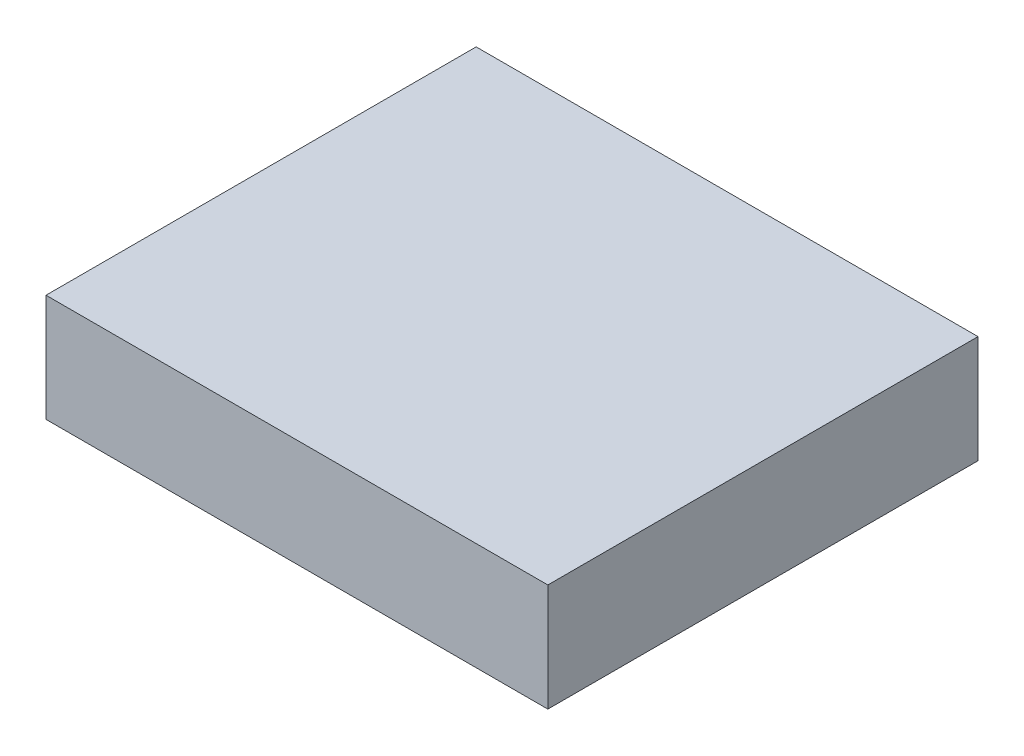
ISO-10303-21;
HEADER;
FILE_DESCRIPTION(('STEP AP214'),'2;1');
FILE_NAME('part.step','',(''),(''),'','','');
FILE_SCHEMA(('AUTOMOTIVE_DESIGN { 1 0 10303 214 1 1 1 1 }'));
ENDSEC;
DATA;
#1=APPLICATION_CONTEXT('core data for automotive mechanical design processes');
#2=APPLICATION_PROTOCOL_DEFINITION('international standard','automotive_design',2000,#1);
#3=PRODUCT_CONTEXT('',#1,'mechanical');
#4=PRODUCT('Part','Part','',(#3));
#5=PRODUCT_RELATED_PRODUCT_CATEGORY('part','',(#4));
#6=PRODUCT_DEFINITION_FORMATION('','',#4);
#7=PRODUCT_DEFINITION_CONTEXT('part definition',#1,'design');
#8=PRODUCT_DEFINITION('design','',#6,#7);
#9=PRODUCT_DEFINITION_SHAPE('','',#8);
#10=(LENGTH_UNIT() NAMED_UNIT(*) SI_UNIT(.MILLI.,.METRE.));
#11=(NAMED_UNIT(*) PLANE_ANGLE_UNIT() SI_UNIT($,.RADIAN.));
#12=(NAMED_UNIT(*) SI_UNIT($,.STERADIAN.) SOLID_ANGLE_UNIT());
#13=UNCERTAINTY_MEASURE_WITH_UNIT(LENGTH_MEASURE(1.E-05),#10,'distance_accuracy_value','');
#14=(GEOMETRIC_REPRESENTATION_CONTEXT(3) GLOBAL_UNCERTAINTY_ASSIGNED_CONTEXT((#13)) GLOBAL_UNIT_ASSIGNED_CONTEXT((#10,
#11,#12)) REPRESENTATION_CONTEXT('',''));
#15=CARTESIAN_POINT('',(0.,0.,0.));
#16=DIRECTION('',(0.,0.,1.));
#17=DIRECTION('',(1.,0.,0.));
#18=AXIS2_PLACEMENT_3D('',#15,#16,#17);
#19=CARTESIAN_POINT('',(-1.84150326797386,0.75,-0.869281045751634));
#20=DIRECTION('',(1.,0.,0.));
#21=DIRECTION('',(0.,0.,-1.));
#22=AXIS2_PLACEMENT_3D('',#19,#20,#21);
#23=PLANE('',#22);
#24=DIRECTION('',(0.,0.,1.));
#25=VECTOR('',#24,1.);
#26=CARTESIAN_POINT('',(-1.84150326797386,0.,-0.869281045751634));
#27=LINE('',#26,#25);
#28=CARTESIAN_POINT('',(-1.84150326797386,0.,-0.869281045751634));
#29=VERTEX_POINT('',#28);
#30=CARTESIAN_POINT('',(-1.84150326797386,0.,2.13071895424837));
#31=VERTEX_POINT('',#30);
#32=EDGE_CURVE('E109',#29,#31,#27,.T.);
#33=ORIENTED_EDGE('',*,*,#32,.T.);
#34=DIRECTION('',(0.,-1.,0.));
#35=VECTOR('',#34,1.);
#36=CARTESIAN_POINT('',(-1.84150326797386,0.75,2.13071895424837));
#37=LINE('',#36,#35);
#38=CARTESIAN_POINT('',(-1.84150326797386,0.75,2.13071895424837));
#39=VERTEX_POINT('',#38);
#40=EDGE_CURVE('E11',#39,#31,#37,.T.);
#41=ORIENTED_EDGE('',*,*,#40,.F.);
#42=DIRECTION('',(0.,0.,1.));
#43=VECTOR('',#42,1.);
#44=CARTESIAN_POINT('',(-1.84150326797386,0.75,-0.869281045751634));
#45=LINE('',#44,#43);
#46=CARTESIAN_POINT('',(-1.84150326797386,0.75,-0.869281045751634));
#47=VERTEX_POINT('',#46);
#48=EDGE_CURVE('E93',#47,#39,#45,.T.);
#49=ORIENTED_EDGE('',*,*,#48,.F.);
#50=DIRECTION('',(0.,-1.,0.));
#51=VECTOR('',#50,1.);
#52=CARTESIAN_POINT('',(-1.84150326797386,0.75,-0.869281045751634));
#53=LINE('',#52,#51);
#54=EDGE_CURVE('E105',#47,#29,#53,.T.);
#55=ORIENTED_EDGE('',*,*,#54,.T.);
#56=EDGE_LOOP('',(#33,#41,#49,#55));
#57=FACE_BOUND('',#56,.T.);
#58=ADVANCED_FACE('F41',(#57),#23,.F.);
#59=CARTESIAN_POINT('',(-1.84150326797386,0.75,2.13071895424837));
#60=DIRECTION('',(0.,0.,-1.));
#61=DIRECTION('',(-1.,0.,0.));
#62=AXIS2_PLACEMENT_3D('',#59,#60,#61);
#63=PLANE('',#62);
#64=DIRECTION('',(1.,0.,0.));
#65=VECTOR('',#64,1.);
#66=CARTESIAN_POINT('',(-1.84150326797386,0.,2.13071895424837));
#67=LINE('',#66,#65);
#68=CARTESIAN_POINT('',(1.65849673202614,0.,2.13071895424837));
#69=VERTEX_POINT('',#68);
#70=EDGE_CURVE('E98',#31,#69,#67,.T.);
#71=ORIENTED_EDGE('',*,*,#70,.T.);
#72=DIRECTION('',(0.,-1.,0.));
#73=VECTOR('',#72,1.);
#74=CARTESIAN_POINT('',(1.65849673202614,0.75,2.13071895424837));
#75=LINE('',#74,#73);
#76=CARTESIAN_POINT('',(1.65849673202614,0.75,2.13071895424837));
#77=VERTEX_POINT('',#76);
#78=EDGE_CURVE('E50',#77,#69,#75,.T.);
#79=ORIENTED_EDGE('',*,*,#78,.F.);
#80=DIRECTION('',(1.,0.,0.));
#81=VECTOR('',#80,1.);
#82=CARTESIAN_POINT('',(-1.84150326797386,0.75,2.13071895424837));
#83=LINE('',#82,#81);
#84=EDGE_CURVE('E88',#39,#77,#83,.T.);
#85=ORIENTED_EDGE('',*,*,#84,.F.);
#86=ORIENTED_EDGE('',*,*,#40,.T.);
#87=EDGE_LOOP('',(#71,#79,#85,#86));
#88=FACE_BOUND('',#87,.T.);
#89=ADVANCED_FACE('F97',(#88),#63,.F.);
#90=CARTESIAN_POINT('',(1.65849673202614,0.75,-0.869281045751634));
#91=DIRECTION('',(-1.,0.,0.));
#92=DIRECTION('',(0.,0.,1.));
#93=AXIS2_PLACEMENT_3D('',#90,#91,#92);
#94=PLANE('',#93);
#95=DIRECTION('',(0.,0.,-1.));
#96=VECTOR('',#95,1.);
#97=CARTESIAN_POINT('',(1.65849673202614,0.,-0.869281045751634));
#98=LINE('',#97,#96);
#99=CARTESIAN_POINT('',(1.65849673202614,0.,-0.869281045751634));
#100=VERTEX_POINT('',#99);
#101=EDGE_CURVE('E75',#69,#100,#98,.T.);
#102=ORIENTED_EDGE('',*,*,#101,.T.);
#103=DIRECTION('',(0.,-1.,0.));
#104=VECTOR('',#103,1.);
#105=CARTESIAN_POINT('',(1.65849673202614,0.75,-0.869281045751634));
#106=LINE('',#105,#104);
#107=CARTESIAN_POINT('',(1.65849673202614,0.75,-0.869281045751634));
#108=VERTEX_POINT('',#107);
#109=EDGE_CURVE('E100',#108,#100,#106,.T.);
#110=ORIENTED_EDGE('',*,*,#109,.F.);
#111=DIRECTION('',(0.,0.,-1.));
#112=VECTOR('',#111,1.);
#113=CARTESIAN_POINT('',(1.65849673202614,0.75,-0.869281045751634));
#114=LINE('',#113,#112);
#115=EDGE_CURVE('E91',#77,#108,#114,.T.);
#116=ORIENTED_EDGE('',*,*,#115,.F.);
#117=ORIENTED_EDGE('',*,*,#78,.T.);
#118=EDGE_LOOP('',(#102,#110,#116,#117));
#119=FACE_BOUND('',#118,.T.);
#120=ADVANCED_FACE('F101',(#119),#94,.F.);
#121=CARTESIAN_POINT('',(-1.84150326797386,0.75,-0.869281045751634));
#122=DIRECTION('',(0.,0.,1.));
#123=DIRECTION('',(1.,0.,0.));
#124=AXIS2_PLACEMENT_3D('',#121,#122,#123);
#125=PLANE('',#124);
#126=DIRECTION('',(-1.,0.,0.));
#127=VECTOR('',#126,1.);
#128=CARTESIAN_POINT('',(-1.84150326797386,0.,-0.869281045751634));
#129=LINE('',#128,#127);
#130=EDGE_CURVE('E81',#100,#29,#129,.T.);
#131=ORIENTED_EDGE('',*,*,#130,.T.);
#132=ORIENTED_EDGE('',*,*,#54,.F.);
#133=DIRECTION('',(-1.,0.,0.));
#134=VECTOR('',#133,1.);
#135=CARTESIAN_POINT('',(-1.84150326797386,0.75,-0.869281045751634));
#136=LINE('',#135,#134);
#137=EDGE_CURVE('E58',#108,#47,#136,.T.);
#138=ORIENTED_EDGE('',*,*,#137,.F.);
#139=ORIENTED_EDGE('',*,*,#109,.T.);
#140=EDGE_LOOP('',(#131,#132,#138,#139));
#141=FACE_BOUND('',#140,.T.);
#142=ADVANCED_FACE('F122',(#141),#125,.F.);
#143=CARTESIAN_POINT('',(0.,0.75,0.));
#144=DIRECTION('',(0.,1.,0.));
#145=DIRECTION('',(0.,0.,1.));
#146=AXIS2_PLACEMENT_3D('',#143,#144,#145);
#147=PLANE('',#146);
#148=ORIENTED_EDGE('',*,*,#48,.T.);
#149=ORIENTED_EDGE('',*,*,#84,.T.);
#150=ORIENTED_EDGE('',*,*,#115,.T.);
#151=ORIENTED_EDGE('',*,*,#137,.T.);
#152=EDGE_LOOP('',(#148,#149,#150,#151));
#153=FACE_BOUND('',#152,.T.);
#154=ADVANCED_FACE('F89',(#153),#147,.T.);
#155=CARTESIAN_POINT('',(0.,0.,0.));
#156=DIRECTION('',(0.,1.,0.));
#157=DIRECTION('',(0.,0.,1.));
#158=AXIS2_PLACEMENT_3D('',#155,#156,#157);
#159=PLANE('',#158);
#160=ORIENTED_EDGE('',*,*,#32,.F.);
#161=ORIENTED_EDGE('',*,*,#130,.F.);
#162=ORIENTED_EDGE('',*,*,#101,.F.);
#163=ORIENTED_EDGE('',*,*,#70,.F.);
#164=EDGE_LOOP('',(#160,#161,#162,#163));
#165=FACE_BOUND('',#164,.T.);
#166=ADVANCED_FACE('F125',(#165),#159,.F.);
#167=CLOSED_SHELL('',(#58,#89,#120,#142,#154,#166));
#168=MANIFOLD_SOLID_BREP('B2',#167);
#169=ADVANCED_BREP_SHAPE_REPRESENTATION('',(#18,#168),#14);
#170=SHAPE_DEFINITION_REPRESENTATION(#9,#169);
ENDSEC;
END-ISO-10303-21;
